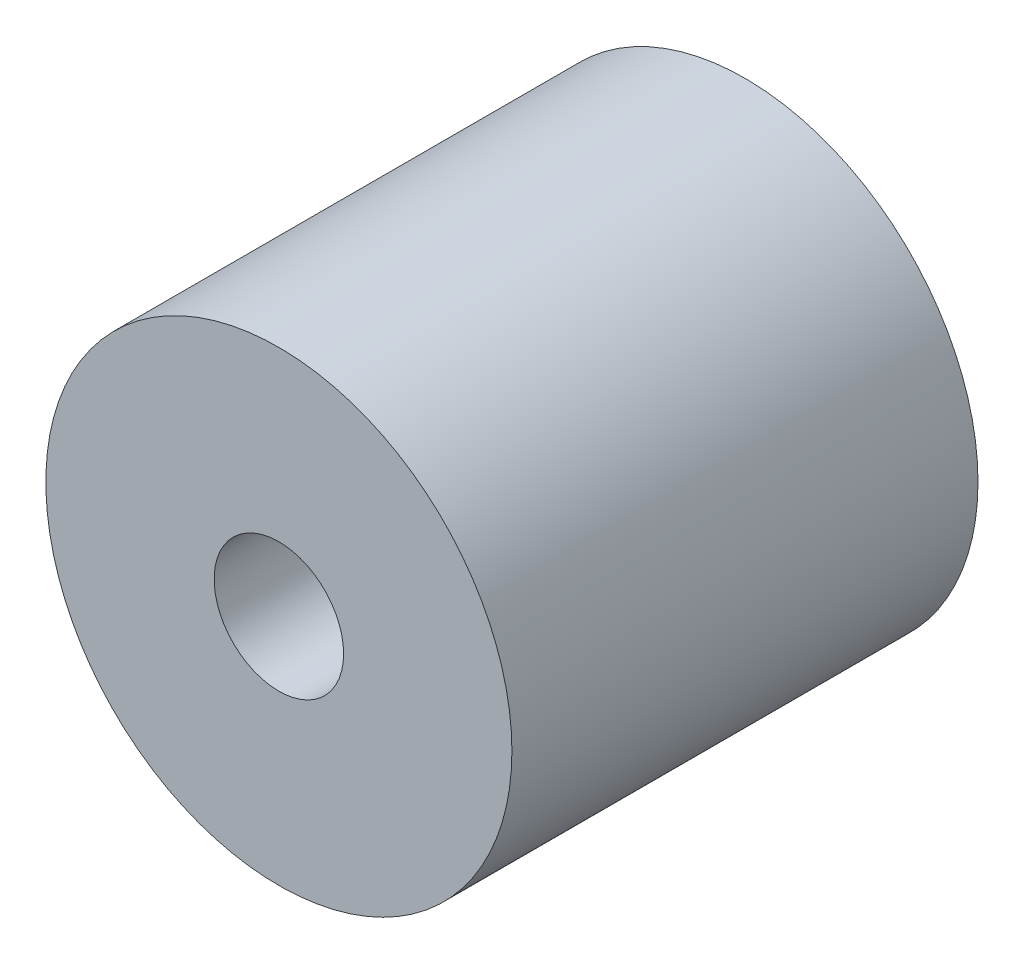
ISO-10303-21;
HEADER;
FILE_DESCRIPTION(('STEP AP214'),'2;1');
FILE_NAME('part.step','',(''),(''),'','','');
FILE_SCHEMA(('AUTOMOTIVE_DESIGN { 1 0 10303 214 1 1 1 1 }'));
ENDSEC;
DATA;
#1=APPLICATION_CONTEXT('core data for automotive mechanical design processes');
#2=APPLICATION_PROTOCOL_DEFINITION('international standard','automotive_design',2000,#1);
#3=PRODUCT_CONTEXT('',#1,'mechanical');
#4=PRODUCT('Part','Part','',(#3));
#5=PRODUCT_RELATED_PRODUCT_CATEGORY('part','',(#4));
#6=PRODUCT_DEFINITION_FORMATION('','',#4);
#7=PRODUCT_DEFINITION_CONTEXT('part definition',#1,'design');
#8=PRODUCT_DEFINITION('design','',#6,#7);
#9=PRODUCT_DEFINITION_SHAPE('','',#8);
#10=(LENGTH_UNIT() NAMED_UNIT(*) SI_UNIT(.MILLI.,.METRE.));
#11=(NAMED_UNIT(*) PLANE_ANGLE_UNIT() SI_UNIT($,.RADIAN.));
#12=(NAMED_UNIT(*) SI_UNIT($,.STERADIAN.) SOLID_ANGLE_UNIT());
#13=UNCERTAINTY_MEASURE_WITH_UNIT(LENGTH_MEASURE(1.E-05),#10,'distance_accuracy_value','');
#14=(GEOMETRIC_REPRESENTATION_CONTEXT(3) GLOBAL_UNCERTAINTY_ASSIGNED_CONTEXT((#13)) GLOBAL_UNIT_ASSIGNED_CONTEXT((#10,
#11,#12)) REPRESENTATION_CONTEXT('',''));
#15=CARTESIAN_POINT('',(0.,0.,0.));
#16=DIRECTION('',(0.,0.,1.));
#17=DIRECTION('',(1.,0.,0.));
#18=AXIS2_PLACEMENT_3D('',#15,#16,#17);
#19=CARTESIAN_POINT('',(0.736104657490314,4.99937746545505,18.));
#20=DIRECTION('',(0.,0.,1.));
#21=DIRECTION('',(1.,0.,0.));
#22=AXIS2_PLACEMENT_3D('',#19,#20,#21);
#23=PLANE('',#22);
#24=CARTESIAN_POINT('',(0.736104657490314,4.99937746545505,18.));
#25=DIRECTION('',(0.,0.,1.));
#26=DIRECTION('',(1.,0.,0.));
#27=AXIS2_PLACEMENT_3D('',#24,#25,#26);
#28=CIRCLE('',#27,9.);
#29=CARTESIAN_POINT('',(9.73610465749031,4.99937746545505,18.));
#30=VERTEX_POINT('',#29);
#31=EDGE_CURVE('E10',#30,#30,#28,.T.);
#32=ORIENTED_EDGE('',*,*,#31,.T.);
#33=EDGE_LOOP('',(#32));
#34=FACE_BOUND('',#33,.T.);
#35=CARTESIAN_POINT('',(0.736104657490314,4.99937746545505,18.));
#36=DIRECTION('',(0.,0.,1.));
#37=DIRECTION('',(1.,0.,0.));
#38=AXIS2_PLACEMENT_3D('',#35,#36,#37);
#39=CIRCLE('',#38,2.5);
#40=CARTESIAN_POINT('',(3.23610465749031,4.99937746545505,18.));
#41=VERTEX_POINT('',#40);
#42=EDGE_CURVE('E48',#41,#41,#39,.T.);
#43=ORIENTED_EDGE('',*,*,#42,.F.);
#44=EDGE_LOOP('',(#43));
#45=FACE_BOUND('',#44,.T.);
#46=ADVANCED_FACE('F37',(#34,#45),#23,.T.);
#47=CARTESIAN_POINT('',(0.736104657490314,4.99937746545505,0.));
#48=DIRECTION('',(0.,0.,1.));
#49=DIRECTION('',(1.,0.,0.));
#50=AXIS2_PLACEMENT_3D('',#47,#48,#49);
#51=PLANE('',#50);
#52=CARTESIAN_POINT('',(0.736104657490314,4.99937746545505,0.));
#53=DIRECTION('',(0.,0.,1.));
#54=DIRECTION('',(1.,0.,0.));
#55=AXIS2_PLACEMENT_3D('',#52,#53,#54);
#56=CIRCLE('',#55,9.);
#57=CARTESIAN_POINT('',(9.73610465749031,4.99937746545505,0.));
#58=VERTEX_POINT('',#57);
#59=EDGE_CURVE('E41',#58,#58,#56,.T.);
#60=ORIENTED_EDGE('',*,*,#59,.F.);
#61=EDGE_LOOP('',(#60));
#62=FACE_BOUND('',#61,.T.);
#63=CARTESIAN_POINT('',(0.736104657490314,4.99937746545505,0.));
#64=DIRECTION('',(0.,0.,1.));
#65=DIRECTION('',(1.,0.,0.));
#66=AXIS2_PLACEMENT_3D('',#63,#64,#65);
#67=CIRCLE('',#66,2.5);
#68=CARTESIAN_POINT('',(3.23610465749031,4.99937746545505,0.));
#69=VERTEX_POINT('',#68);
#70=EDGE_CURVE('E50',#69,#69,#67,.T.);
#71=ORIENTED_EDGE('',*,*,#70,.T.);
#72=EDGE_LOOP('',(#71));
#73=FACE_BOUND('',#72,.T.);
#74=ADVANCED_FACE('F60',(#62,#73),#51,.F.);
#75=CARTESIAN_POINT('',(0.736104657490314,4.99937746545505,18.));
#76=DIRECTION('',(0.,0.,-1.));
#77=DIRECTION('',(-1.,0.,0.));
#78=AXIS2_PLACEMENT_3D('',#75,#76,#77);
#79=CYLINDRICAL_SURFACE('',#78,9.);
#80=ORIENTED_EDGE('',*,*,#31,.F.);
#81=EDGE_LOOP('',(#80));
#82=FACE_BOUND('',#81,.T.);
#83=ORIENTED_EDGE('',*,*,#59,.T.);
#84=EDGE_LOOP('',(#83));
#85=FACE_BOUND('',#84,.T.);
#86=ADVANCED_FACE('F39',(#82,#85),#79,.T.);
#87=CARTESIAN_POINT('',(0.736104657490314,4.99937746545505,18.));
#88=DIRECTION('',(0.,0.,-1.));
#89=DIRECTION('',(-1.,0.,0.));
#90=AXIS2_PLACEMENT_3D('',#87,#88,#89);
#91=CYLINDRICAL_SURFACE('',#90,2.5);
#92=ORIENTED_EDGE('',*,*,#42,.T.);
#93=EDGE_LOOP('',(#92));
#94=FACE_BOUND('',#93,.T.);
#95=ORIENTED_EDGE('',*,*,#70,.F.);
#96=EDGE_LOOP('',(#95));
#97=FACE_BOUND('',#96,.T.);
#98=ADVANCED_FACE('F56',(#94,#97),#91,.F.);
#99=CLOSED_SHELL('',(#46,#74,#86,#98));
#100=MANIFOLD_SOLID_BREP('B2',#99);
#101=ADVANCED_BREP_SHAPE_REPRESENTATION('',(#18,#100),#14);
#102=SHAPE_DEFINITION_REPRESENTATION(#9,#101);
ENDSEC;
END-ISO-10303-21;
